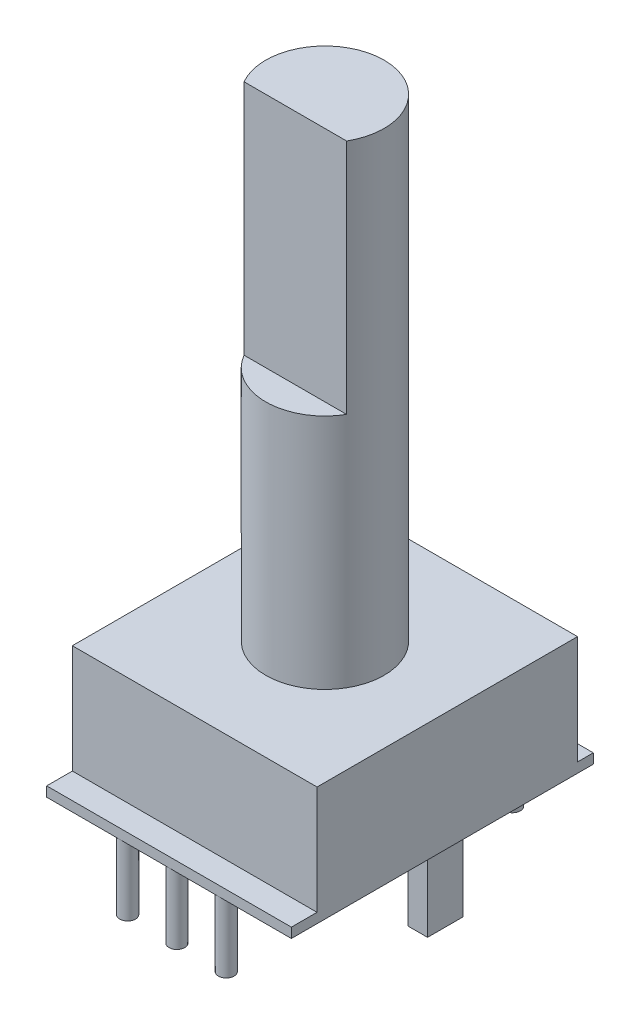
ISO-10303-21;
HEADER;
FILE_DESCRIPTION(('STEP AP214'),'2;1');
FILE_NAME('part.step','',(''),(''),'','','');
FILE_SCHEMA(('AUTOMOTIVE_DESIGN { 1 0 10303 214 1 1 1 1 }'));
ENDSEC;
DATA;
#1=APPLICATION_CONTEXT('core data for automotive mechanical design processes');
#2=APPLICATION_PROTOCOL_DEFINITION('international standard','automotive_design',2000,#1);
#3=PRODUCT_CONTEXT('',#1,'mechanical');
#4=PRODUCT('Part','Part','',(#3));
#5=PRODUCT_RELATED_PRODUCT_CATEGORY('part','',(#4));
#6=PRODUCT_DEFINITION_FORMATION('','',#4);
#7=PRODUCT_DEFINITION_CONTEXT('part definition',#1,'design');
#8=PRODUCT_DEFINITION('design','',#6,#7);
#9=PRODUCT_DEFINITION_SHAPE('','',#8);
#10=(LENGTH_UNIT() NAMED_UNIT(*) SI_UNIT(.MILLI.,.METRE.));
#11=(NAMED_UNIT(*) PLANE_ANGLE_UNIT() SI_UNIT($,.RADIAN.));
#12=(NAMED_UNIT(*) SI_UNIT($,.STERADIAN.) SOLID_ANGLE_UNIT());
#13=UNCERTAINTY_MEASURE_WITH_UNIT(LENGTH_MEASURE(1.E-05),#10,'distance_accuracy_value','');
#14=(GEOMETRIC_REPRESENTATION_CONTEXT(3) GLOBAL_UNCERTAINTY_ASSIGNED_CONTEXT((#13)) GLOBAL_UNIT_ASSIGNED_CONTEXT((#10,
#11,#12)) REPRESENTATION_CONTEXT('',''));
#15=CARTESIAN_POINT('',(0.,0.,0.));
#16=DIRECTION('',(0.,0.,1.));
#17=DIRECTION('',(1.,0.,0.));
#18=AXIS2_PLACEMENT_3D('',#15,#16,#17);
#19=CARTESIAN_POINT('',(0.,0.5,0.));
#20=DIRECTION('',(0.,1.,0.));
#21=DIRECTION('',(0.,0.,1.));
#22=AXIS2_PLACEMENT_3D('',#19,#20,#21);
#23=PLANE('',#22);
#24=DIRECTION('',(0.,0.,1.));
#25=VECTOR('',#24,1.);
#26=CARTESIAN_POINT('',(-6.2,0.5,-7.4));
#27=LINE('',#26,#25);
#28=CARTESIAN_POINT('',(-6.2,0.5,-7.4));
#29=VERTEX_POINT('',#28);
#30=CARTESIAN_POINT('',(-6.2,0.5,-6.6));
#31=VERTEX_POINT('',#30);
#32=EDGE_CURVE('E300',#29,#31,#27,.T.);
#33=ORIENTED_EDGE('',*,*,#32,.T.);
#34=DIRECTION('',(1.,0.,0.));
#35=VECTOR('',#34,1.);
#36=CARTESIAN_POINT('',(0.,0.5,-6.6));
#37=LINE('',#36,#35);
#38=CARTESIAN_POINT('',(6.2,0.5,-6.6));
#39=VERTEX_POINT('',#38);
#40=EDGE_CURVE('E37',#31,#39,#37,.T.);
#41=ORIENTED_EDGE('',*,*,#40,.T.);
#42=DIRECTION('',(0.,0.,-1.));
#43=VECTOR('',#42,1.);
#44=CARTESIAN_POINT('',(6.2,0.5,-7.4));
#45=LINE('',#44,#43);
#46=CARTESIAN_POINT('',(6.2,0.5,-7.4));
#47=VERTEX_POINT('',#46);
#48=EDGE_CURVE('E306',#39,#47,#45,.T.);
#49=ORIENTED_EDGE('',*,*,#48,.T.);
#50=DIRECTION('',(-1.,0.,0.));
#51=VECTOR('',#50,1.);
#52=CARTESIAN_POINT('',(-6.2,0.5,-7.4));
#53=LINE('',#52,#51);
#54=EDGE_CURVE('E310',#47,#29,#53,.T.);
#55=ORIENTED_EDGE('',*,*,#54,.T.);
#56=EDGE_LOOP('',(#33,#41,#49,#55));
#57=FACE_BOUND('',#56,.T.);
#58=ADVANCED_FACE('F33',(#57),#23,.T.);
#59=CARTESIAN_POINT('',(6.2,0.5,7.9));
#60=VERTEX_POINT('',#59);
#61=CARTESIAN_POINT('',(6.2,0.5,6.6));
#62=VERTEX_POINT('',#61);
#63=EDGE_CURVE('E307',#60,#62,#45,.T.);
#64=ORIENTED_EDGE('',*,*,#63,.T.);
#65=DIRECTION('',(-1.,0.,0.));
#66=VECTOR('',#65,1.);
#67=CARTESIAN_POINT('',(0.,0.5,6.6));
#68=LINE('',#67,#66);
#69=CARTESIAN_POINT('',(-6.2,0.5,6.6));
#70=VERTEX_POINT('',#69);
#71=EDGE_CURVE('E341',#62,#70,#68,.T.);
#72=ORIENTED_EDGE('',*,*,#71,.T.);
#73=CARTESIAN_POINT('',(-6.2,0.5,7.9));
#74=VERTEX_POINT('',#73);
#75=EDGE_CURVE('E304',#70,#74,#27,.T.);
#76=ORIENTED_EDGE('',*,*,#75,.T.);
#77=DIRECTION('',(1.,0.,0.));
#78=VECTOR('',#77,1.);
#79=CARTESIAN_POINT('',(-6.2,0.5,7.9));
#80=LINE('',#79,#78);
#81=EDGE_CURVE('E303',#74,#60,#80,.T.);
#82=ORIENTED_EDGE('',*,*,#81,.T.);
#83=EDGE_LOOP('',(#64,#72,#76,#82));
#84=FACE_BOUND('',#83,.T.);
#85=ADVANCED_FACE('F377',(#84),#23,.T.);
#86=CARTESIAN_POINT('',(-2.5,-3.5,7.5));
#87=DIRECTION('',(0.,1.,0.));
#88=DIRECTION('',(0.,0.,1.));
#89=AXIS2_PLACEMENT_3D('',#86,#87,#88);
#90=CYLINDRICAL_SURFACE('',#89,0.4);
#91=CARTESIAN_POINT('',(-2.5,-3.5,7.5));
#92=DIRECTION('',(0.,1.,0.));
#93=DIRECTION('',(0.,0.,1.));
#94=AXIS2_PLACEMENT_3D('',#91,#92,#93);
#95=CIRCLE('',#94,0.4);
#96=CARTESIAN_POINT('',(-2.5,-3.5,7.9));
#97=VERTEX_POINT('',#96);
#98=EDGE_CURVE('E338',#97,#97,#95,.T.);
#99=ORIENTED_EDGE('',*,*,#98,.T.);
#100=EDGE_LOOP('',(#99));
#101=FACE_BOUND('',#100,.T.);
#102=CARTESIAN_POINT('',(-2.5,0.,7.5));
#103=DIRECTION('',(0.,1.,0.));
#104=DIRECTION('',(0.,0.,1.));
#105=AXIS2_PLACEMENT_3D('',#102,#103,#104);
#106=CIRCLE('',#105,0.4);
#107=CARTESIAN_POINT('',(-2.5,0.,7.9));
#108=VERTEX_POINT('',#107);
#109=EDGE_CURVE('E337',#108,#108,#106,.T.);
#110=ORIENTED_EDGE('',*,*,#109,.F.);
#111=EDGE_LOOP('',(#110));
#112=FACE_BOUND('',#111,.T.);
#113=ADVANCED_FACE('F35',(#101,#112),#90,.T.);
#114=CARTESIAN_POINT('',(-2.5,-3.5,7.5));
#115=DIRECTION('',(0.,1.,0.));
#116=DIRECTION('',(0.,0.,1.));
#117=AXIS2_PLACEMENT_3D('',#114,#115,#116);
#118=PLANE('',#117);
#119=ORIENTED_EDGE('',*,*,#98,.F.);
#120=EDGE_LOOP('',(#119));
#121=FACE_BOUND('',#120,.T.);
#122=ADVANCED_FACE('F418',(#121),#118,.F.);
#123=CARTESIAN_POINT('',(0.,0.,0.));
#124=DIRECTION('',(0.,1.,0.));
#125=DIRECTION('',(0.,0.,1.));
#126=AXIS2_PLACEMENT_3D('',#123,#124,#125);
#127=PLANE('',#126);
#128=DIRECTION('',(-1.,0.,0.));
#129=VECTOR('',#128,1.);
#130=CARTESIAN_POINT('',(-6.1,0.,-0.899999999999999));
#131=LINE('',#130,#129);
#132=CARTESIAN_POINT('',(-5.1,0.,-0.9));
#133=VERTEX_POINT('',#132);
#134=CARTESIAN_POINT('',(-6.1,0.,-0.899999999999999));
#135=VERTEX_POINT('',#134);
#136=EDGE_CURVE('E251',#133,#135,#131,.T.);
#137=ORIENTED_EDGE('',*,*,#136,.T.);
#138=DIRECTION('',(0.,0.,1.));
#139=VECTOR('',#138,1.);
#140=CARTESIAN_POINT('',(-6.1,0.,-0.899999999999999));
#141=LINE('',#140,#139);
#142=CARTESIAN_POINT('',(-6.1,0.,0.900000000000001));
#143=VERTEX_POINT('',#142);
#144=EDGE_CURVE('E246',#135,#143,#141,.T.);
#145=ORIENTED_EDGE('',*,*,#144,.T.);
#146=DIRECTION('',(1.,0.,0.));
#147=VECTOR('',#146,1.);
#148=CARTESIAN_POINT('',(-6.1,0.,0.900000000000001));
#149=LINE('',#148,#147);
#150=CARTESIAN_POINT('',(-5.1,0.,0.900000000000001));
#151=VERTEX_POINT('',#150);
#152=EDGE_CURVE('E263',#143,#151,#149,.T.);
#153=ORIENTED_EDGE('',*,*,#152,.T.);
#154=DIRECTION('',(0.,0.,-1.));
#155=VECTOR('',#154,1.);
#156=CARTESIAN_POINT('',(-5.1,0.,-0.9));
#157=LINE('',#156,#155);
#158=EDGE_CURVE('E57',#151,#133,#157,.T.);
#159=ORIENTED_EDGE('',*,*,#158,.T.);
#160=EDGE_LOOP('',(#137,#145,#153,#159));
#161=FACE_BOUND('',#160,.T.);
#162=DIRECTION('',(-1.,0.,0.));
#163=VECTOR('',#162,1.);
#164=CARTESIAN_POINT('',(5.1,0.,-0.9));
#165=LINE('',#164,#163);
#166=CARTESIAN_POINT('',(6.1,0.,-0.9));
#167=VERTEX_POINT('',#166);
#168=CARTESIAN_POINT('',(5.1,0.,-0.9));
#169=VERTEX_POINT('',#168);
#170=EDGE_CURVE('E200',#167,#169,#165,.T.);
#171=ORIENTED_EDGE('',*,*,#170,.T.);
#172=DIRECTION('',(0.,0.,1.));
#173=VECTOR('',#172,1.);
#174=CARTESIAN_POINT('',(5.1,0.,-0.9));
#175=LINE('',#174,#173);
#176=CARTESIAN_POINT('',(5.1,0.,0.900000000000001));
#177=VERTEX_POINT('',#176);
#178=EDGE_CURVE('E194',#169,#177,#175,.T.);
#179=ORIENTED_EDGE('',*,*,#178,.T.);
#180=DIRECTION('',(1.,0.,0.));
#181=VECTOR('',#180,1.);
#182=CARTESIAN_POINT('',(5.1,0.,0.900000000000001));
#183=LINE('',#182,#181);
#184=CARTESIAN_POINT('',(6.1,0.,0.900000000000001));
#185=VERTEX_POINT('',#184);
#186=EDGE_CURVE('E212',#177,#185,#183,.T.);
#187=ORIENTED_EDGE('',*,*,#186,.T.);
#188=DIRECTION('',(0.,0.,-1.));
#189=VECTOR('',#188,1.);
#190=CARTESIAN_POINT('',(6.1,0.,-0.9));
#191=LINE('',#190,#189);
#192=EDGE_CURVE('E215',#185,#167,#191,.T.);
#193=ORIENTED_EDGE('',*,*,#192,.T.);
#194=EDGE_LOOP('',(#171,#179,#187,#193));
#195=FACE_BOUND('',#194,.T.);
#196=DIRECTION('',(1.,0.,0.));
#197=VECTOR('',#196,1.);
#198=CARTESIAN_POINT('',(-6.2,0.,7.9));
#199=LINE('',#198,#197);
#200=CARTESIAN_POINT('',(-6.2,0.,7.9));
#201=VERTEX_POINT('',#200);
#202=EDGE_CURVE('E315',#201,#108,#199,.T.);
#203=ORIENTED_EDGE('',*,*,#202,.F.);
#204=DIRECTION('',(0.,0.,1.));
#205=VECTOR('',#204,1.);
#206=CARTESIAN_POINT('',(-6.2,0.,-7.4));
#207=LINE('',#206,#205);
#208=CARTESIAN_POINT('',(-6.2,0.,-7.4));
#209=VERTEX_POINT('',#208);
#210=EDGE_CURVE('E297',#209,#201,#207,.T.);
#211=ORIENTED_EDGE('',*,*,#210,.F.);
#212=DIRECTION('',(-1.,0.,0.));
#213=VECTOR('',#212,1.);
#214=CARTESIAN_POINT('',(-6.2,0.,-7.4));
#215=LINE('',#214,#213);
#216=CARTESIAN_POINT('',(-2.5,0.,-7.4));
#217=VERTEX_POINT('',#216);
#218=EDGE_CURVE('E321',#217,#209,#215,.T.);
#219=ORIENTED_EDGE('',*,*,#218,.F.);
#220=CARTESIAN_POINT('',(-2.5,0.,-7.));
#221=DIRECTION('',(0.,1.,0.));
#222=DIRECTION('',(0.,0.,1.));
#223=AXIS2_PLACEMENT_3D('',#220,#221,#222);
#224=CIRCLE('',#223,0.4);
#225=EDGE_CURVE('E272',#217,#217,#224,.T.);
#226=ORIENTED_EDGE('',*,*,#225,.T.);
#227=CARTESIAN_POINT('',(2.5,0.,-7.4));
#228=VERTEX_POINT('',#227);
#229=EDGE_CURVE('E325',#228,#217,#215,.T.);
#230=ORIENTED_EDGE('',*,*,#229,.F.);
#231=CARTESIAN_POINT('',(2.5,0.,-7.));
#232=DIRECTION('',(0.,1.,0.));
#233=DIRECTION('',(0.,0.,1.));
#234=AXIS2_PLACEMENT_3D('',#231,#232,#233);
#235=CIRCLE('',#234,0.4);
#236=EDGE_CURVE('E281',#228,#228,#235,.T.);
#237=ORIENTED_EDGE('',*,*,#236,.T.);
#238=CARTESIAN_POINT('',(6.2,0.,-7.4));
#239=VERTEX_POINT('',#238);
#240=EDGE_CURVE('E322',#239,#228,#215,.T.);
#241=ORIENTED_EDGE('',*,*,#240,.F.);
#242=DIRECTION('',(0.,0.,-1.));
#243=VECTOR('',#242,1.);
#244=CARTESIAN_POINT('',(6.2,0.,-7.4));
#245=LINE('',#244,#243);
#246=CARTESIAN_POINT('',(6.2,0.,7.9));
#247=VERTEX_POINT('',#246);
#248=EDGE_CURVE('E318',#247,#239,#245,.T.);
#249=ORIENTED_EDGE('',*,*,#248,.F.);
#250=CARTESIAN_POINT('',(2.5,0.,7.9));
#251=VERTEX_POINT('',#250);
#252=EDGE_CURVE('E314',#251,#247,#199,.T.);
#253=ORIENTED_EDGE('',*,*,#252,.F.);
#254=CARTESIAN_POINT('',(2.5,0.,7.5));
#255=DIRECTION('',(0.,1.,0.));
#256=DIRECTION('',(0.,0.,1.));
#257=AXIS2_PLACEMENT_3D('',#254,#255,#256);
#258=CIRCLE('',#257,0.4);
#259=EDGE_CURVE('E286',#251,#251,#258,.T.);
#260=ORIENTED_EDGE('',*,*,#259,.T.);
#261=CARTESIAN_POINT('',(0.,0.,7.9));
#262=VERTEX_POINT('',#261);
#263=EDGE_CURVE('E438',#262,#251,#199,.T.);
#264=ORIENTED_EDGE('',*,*,#263,.F.);
#265=CARTESIAN_POINT('',(0.,0.,7.5));
#266=DIRECTION('',(0.,1.,0.));
#267=DIRECTION('',(0.,0.,1.));
#268=AXIS2_PLACEMENT_3D('',#265,#266,#267);
#269=CIRCLE('',#268,0.4);
#270=EDGE_CURVE('E291',#262,#262,#269,.T.);
#271=ORIENTED_EDGE('',*,*,#270,.T.);
#272=EDGE_CURVE('E319',#108,#262,#199,.T.);
#273=ORIENTED_EDGE('',*,*,#272,.F.);
#274=ORIENTED_EDGE('',*,*,#109,.T.);
#275=EDGE_LOOP('',(#203,#211,#219,#226,#230,#237,#241,#249,#253,#260,#264,#271,#273,#274));
#276=FACE_BOUND('',#275,.T.);
#277=ADVANCED_FACE('F387',(#161,#195,#276),#127,.F.);
#278=CARTESIAN_POINT('',(-6.2,0.5,-7.4));
#279=DIRECTION('',(1.,0.,0.));
#280=DIRECTION('',(0.,0.,-1.));
#281=AXIS2_PLACEMENT_3D('',#278,#279,#280);
#282=PLANE('',#281);
#283=ORIENTED_EDGE('',*,*,#210,.T.);
#284=DIRECTION('',(0.,-1.,0.));
#285=VECTOR('',#284,1.);
#286=CARTESIAN_POINT('',(-6.2,0.5,7.9));
#287=LINE('',#286,#285);
#288=EDGE_CURVE('E334',#74,#201,#287,.T.);
#289=ORIENTED_EDGE('',*,*,#288,.F.);
#290=ORIENTED_EDGE('',*,*,#75,.F.);
#291=DIRECTION('',(0.,-1.,0.));
#292=VECTOR('',#291,1.);
#293=CARTESIAN_POINT('',(-6.2,6.,6.6));
#294=LINE('',#293,#292);
#295=CARTESIAN_POINT('',(-6.2,6.,6.6));
#296=VERTEX_POINT('',#295);
#297=EDGE_CURVE('E239',#296,#70,#294,.T.);
#298=ORIENTED_EDGE('',*,*,#297,.F.);
#299=DIRECTION('',(0.,0.,1.));
#300=VECTOR('',#299,1.);
#301=CARTESIAN_POINT('',(-6.2,6.,-6.6));
#302=LINE('',#301,#300);
#303=CARTESIAN_POINT('',(-6.2,6.,-6.6));
#304=VERTEX_POINT('',#303);
#305=EDGE_CURVE('E232',#304,#296,#302,.T.);
#306=ORIENTED_EDGE('',*,*,#305,.F.);
#307=DIRECTION('',(0.,-1.,0.));
#308=VECTOR('',#307,1.);
#309=CARTESIAN_POINT('',(-6.2,6.,-6.6));
#310=LINE('',#309,#308);
#311=EDGE_CURVE('E241',#304,#31,#310,.T.);
#312=ORIENTED_EDGE('',*,*,#311,.T.);
#313=ORIENTED_EDGE('',*,*,#32,.F.);
#314=DIRECTION('',(0.,-1.,0.));
#315=VECTOR('',#314,1.);
#316=CARTESIAN_POINT('',(-6.2,0.5,-7.4));
#317=LINE('',#316,#315);
#318=EDGE_CURVE('E312',#29,#209,#317,.T.);
#319=ORIENTED_EDGE('',*,*,#318,.T.);
#320=EDGE_LOOP('',(#283,#289,#290,#298,#306,#312,#313,#319));
#321=FACE_BOUND('',#320,.T.);
#322=ADVANCED_FACE('F367',(#321),#282,.F.);
#323=CARTESIAN_POINT('',(-6.2,0.5,7.9));
#324=DIRECTION('',(0.,0.,-1.));
#325=DIRECTION('',(-1.,0.,0.));
#326=AXIS2_PLACEMENT_3D('',#323,#324,#325);
#327=PLANE('',#326);
#328=ORIENTED_EDGE('',*,*,#202,.T.);
#329=ORIENTED_EDGE('',*,*,#272,.T.);
#330=ORIENTED_EDGE('',*,*,#263,.T.);
#331=ORIENTED_EDGE('',*,*,#252,.T.);
#332=DIRECTION('',(0.,-1.,0.));
#333=VECTOR('',#332,1.);
#334=CARTESIAN_POINT('',(6.2,0.5,7.9));
#335=LINE('',#334,#333);
#336=EDGE_CURVE('E331',#60,#247,#335,.T.);
#337=ORIENTED_EDGE('',*,*,#336,.F.);
#338=ORIENTED_EDGE('',*,*,#81,.F.);
#339=ORIENTED_EDGE('',*,*,#288,.T.);
#340=EDGE_LOOP('',(#328,#329,#330,#331,#337,#338,#339));
#341=FACE_BOUND('',#340,.T.);
#342=ADVANCED_FACE('F382',(#341),#327,.F.);
#343=CARTESIAN_POINT('',(6.2,0.5,-7.4));
#344=DIRECTION('',(-1.,0.,0.));
#345=DIRECTION('',(0.,0.,1.));
#346=AXIS2_PLACEMENT_3D('',#343,#344,#345);
#347=PLANE('',#346);
#348=ORIENTED_EDGE('',*,*,#248,.T.);
#349=DIRECTION('',(0.,-1.,0.));
#350=VECTOR('',#349,1.);
#351=CARTESIAN_POINT('',(6.2,0.5,-7.4));
#352=LINE('',#351,#350);
#353=EDGE_CURVE('E328',#47,#239,#352,.T.);
#354=ORIENTED_EDGE('',*,*,#353,.F.);
#355=ORIENTED_EDGE('',*,*,#48,.F.);
#356=DIRECTION('',(0.,-1.,0.));
#357=VECTOR('',#356,1.);
#358=CARTESIAN_POINT('',(6.2,6.,-6.6));
#359=LINE('',#358,#357);
#360=CARTESIAN_POINT('',(6.2,6.,-6.6));
#361=VERTEX_POINT('',#360);
#362=EDGE_CURVE('E244',#361,#39,#359,.T.);
#363=ORIENTED_EDGE('',*,*,#362,.F.);
#364=DIRECTION('',(0.,0.,-1.));
#365=VECTOR('',#364,1.);
#366=CARTESIAN_POINT('',(6.2,6.,-6.6));
#367=LINE('',#366,#365);
#368=CARTESIAN_POINT('',(6.2,6.,6.6));
#369=VERTEX_POINT('',#368);
#370=EDGE_CURVE('E222',#369,#361,#367,.T.);
#371=ORIENTED_EDGE('',*,*,#370,.F.);
#372=DIRECTION('',(0.,-1.,0.));
#373=VECTOR('',#372,1.);
#374=CARTESIAN_POINT('',(6.2,6.,6.6));
#375=LINE('',#374,#373);
#376=EDGE_CURVE('E236',#369,#62,#375,.T.);
#377=ORIENTED_EDGE('',*,*,#376,.T.);
#378=ORIENTED_EDGE('',*,*,#63,.F.);
#379=ORIENTED_EDGE('',*,*,#336,.T.);
#380=EDGE_LOOP('',(#348,#354,#355,#363,#371,#377,#378,#379));
#381=FACE_BOUND('',#380,.T.);
#382=ADVANCED_FACE('F355',(#381),#347,.F.);
#383=CARTESIAN_POINT('',(-6.2,0.5,-7.4));
#384=DIRECTION('',(0.,0.,1.));
#385=DIRECTION('',(1.,0.,0.));
#386=AXIS2_PLACEMENT_3D('',#383,#384,#385);
#387=PLANE('',#386);
#388=ORIENTED_EDGE('',*,*,#240,.T.);
#389=ORIENTED_EDGE('',*,*,#229,.T.);
#390=ORIENTED_EDGE('',*,*,#218,.T.);
#391=ORIENTED_EDGE('',*,*,#318,.F.);
#392=ORIENTED_EDGE('',*,*,#54,.F.);
#393=ORIENTED_EDGE('',*,*,#353,.T.);
#394=EDGE_LOOP('',(#388,#389,#390,#391,#392,#393));
#395=FACE_BOUND('',#394,.T.);
#396=ADVANCED_FACE('F362',(#395),#387,.F.);
#397=CARTESIAN_POINT('',(0.,-3.5,7.5));
#398=DIRECTION('',(0.,1.,0.));
#399=DIRECTION('',(0.,0.,1.));
#400=AXIS2_PLACEMENT_3D('',#397,#398,#399);
#401=CYLINDRICAL_SURFACE('',#400,0.4);
#402=CARTESIAN_POINT('',(0.,-3.5,7.5));
#403=DIRECTION('',(0.,1.,0.));
#404=DIRECTION('',(0.,0.,1.));
#405=AXIS2_PLACEMENT_3D('',#402,#403,#404);
#406=CIRCLE('',#405,0.4);
#407=CARTESIAN_POINT('',(0.,-3.5,7.9));
#408=VERTEX_POINT('',#407);
#409=EDGE_CURVE('E294',#408,#408,#406,.T.);
#410=ORIENTED_EDGE('',*,*,#409,.T.);
#411=EDGE_LOOP('',(#410));
#412=FACE_BOUND('',#411,.T.);
#413=ORIENTED_EDGE('',*,*,#270,.F.);
#414=EDGE_LOOP('',(#413));
#415=FACE_BOUND('',#414,.T.);
#416=ADVANCED_FACE('F414',(#412,#415),#401,.T.);
#417=CARTESIAN_POINT('',(0.,-3.5,7.5));
#418=DIRECTION('',(0.,1.,0.));
#419=DIRECTION('',(0.,0.,1.));
#420=AXIS2_PLACEMENT_3D('',#417,#418,#419);
#421=PLANE('',#420);
#422=ORIENTED_EDGE('',*,*,#409,.F.);
#423=EDGE_LOOP('',(#422));
#424=FACE_BOUND('',#423,.T.);
#425=ADVANCED_FACE('F649',(#424),#421,.F.);
#426=CARTESIAN_POINT('',(2.5,-3.5,7.5));
#427=DIRECTION('',(0.,1.,0.));
#428=DIRECTION('',(0.,0.,1.));
#429=AXIS2_PLACEMENT_3D('',#426,#427,#428);
#430=CYLINDRICAL_SURFACE('',#429,0.4);
#431=CARTESIAN_POINT('',(2.5,-3.5,7.5));
#432=DIRECTION('',(0.,1.,0.));
#433=DIRECTION('',(0.,0.,1.));
#434=AXIS2_PLACEMENT_3D('',#431,#432,#433);
#435=CIRCLE('',#434,0.4);
#436=CARTESIAN_POINT('',(2.5,-3.5,7.9));
#437=VERTEX_POINT('',#436);
#438=EDGE_CURVE('E288',#437,#437,#435,.T.);
#439=ORIENTED_EDGE('',*,*,#438,.T.);
#440=EDGE_LOOP('',(#439));
#441=FACE_BOUND('',#440,.T.);
#442=ORIENTED_EDGE('',*,*,#259,.F.);
#443=EDGE_LOOP('',(#442));
#444=FACE_BOUND('',#443,.T.);
#445=ADVANCED_FACE('F657',(#441,#444),#430,.T.);
#446=CARTESIAN_POINT('',(2.5,-3.5,7.5));
#447=DIRECTION('',(0.,1.,0.));
#448=DIRECTION('',(0.,0.,1.));
#449=AXIS2_PLACEMENT_3D('',#446,#447,#448);
#450=PLANE('',#449);
#451=ORIENTED_EDGE('',*,*,#438,.F.);
#452=EDGE_LOOP('',(#451));
#453=FACE_BOUND('',#452,.T.);
#454=ADVANCED_FACE('F665',(#453),#450,.F.);
#455=CARTESIAN_POINT('',(2.5,-3.5,-7.));
#456=DIRECTION('',(0.,1.,0.));
#457=DIRECTION('',(0.,0.,1.));
#458=AXIS2_PLACEMENT_3D('',#455,#456,#457);
#459=CYLINDRICAL_SURFACE('',#458,0.4);
#460=CARTESIAN_POINT('',(2.5,-3.5,-7.));
#461=DIRECTION('',(0.,1.,0.));
#462=DIRECTION('',(0.,0.,1.));
#463=AXIS2_PLACEMENT_3D('',#460,#461,#462);
#464=CIRCLE('',#463,0.4);
#465=CARTESIAN_POINT('',(2.5,-3.5,-6.6));
#466=VERTEX_POINT('',#465);
#467=EDGE_CURVE('E283',#466,#466,#464,.T.);
#468=ORIENTED_EDGE('',*,*,#467,.T.);
#469=EDGE_LOOP('',(#468));
#470=FACE_BOUND('',#469,.T.);
#471=ORIENTED_EDGE('',*,*,#236,.F.);
#472=EDGE_LOOP('',(#471));
#473=FACE_BOUND('',#472,.T.);
#474=ADVANCED_FACE('F404',(#470,#473),#459,.T.);
#475=CARTESIAN_POINT('',(2.5,-3.5,-7.));
#476=DIRECTION('',(0.,1.,0.));
#477=DIRECTION('',(0.,0.,1.));
#478=AXIS2_PLACEMENT_3D('',#475,#476,#477);
#479=PLANE('',#478);
#480=ORIENTED_EDGE('',*,*,#467,.F.);
#481=EDGE_LOOP('',(#480));
#482=FACE_BOUND('',#481,.T.);
#483=ADVANCED_FACE('F395',(#482),#479,.F.);
#484=CARTESIAN_POINT('',(-2.5,-3.5,-7.));
#485=DIRECTION('',(0.,1.,0.));
#486=DIRECTION('',(0.,0.,1.));
#487=AXIS2_PLACEMENT_3D('',#484,#485,#486);
#488=CYLINDRICAL_SURFACE('',#487,0.4);
#489=CARTESIAN_POINT('',(-2.5,-3.5,-7.));
#490=DIRECTION('',(0.,1.,0.));
#491=DIRECTION('',(0.,0.,1.));
#492=AXIS2_PLACEMENT_3D('',#489,#490,#491);
#493=CIRCLE('',#492,0.4);
#494=CARTESIAN_POINT('',(-2.5,-3.5,-6.6));
#495=VERTEX_POINT('',#494);
#496=EDGE_CURVE('E278',#495,#495,#493,.T.);
#497=ORIENTED_EDGE('',*,*,#496,.T.);
#498=EDGE_LOOP('',(#497));
#499=FACE_BOUND('',#498,.T.);
#500=ORIENTED_EDGE('',*,*,#225,.F.);
#501=EDGE_LOOP('',(#500));
#502=FACE_BOUND('',#501,.T.);
#503=ADVANCED_FACE('F392',(#499,#502),#488,.T.);
#504=CARTESIAN_POINT('',(-2.5,-3.5,-7.));
#505=DIRECTION('',(0.,1.,0.));
#506=DIRECTION('',(0.,0.,1.));
#507=AXIS2_PLACEMENT_3D('',#504,#505,#506);
#508=PLANE('',#507);
#509=ORIENTED_EDGE('',*,*,#496,.F.);
#510=EDGE_LOOP('',(#509));
#511=FACE_BOUND('',#510,.T.);
#512=ADVANCED_FACE('F394',(#511),#508,.F.);
#513=CARTESIAN_POINT('',(0.,6.,0.));
#514=DIRECTION('',(0.,1.,0.));
#515=DIRECTION('',(0.,0.,1.));
#516=AXIS2_PLACEMENT_3D('',#513,#514,#515);
#517=PLANE('',#516);
#518=CARTESIAN_POINT('',(0.,6.,0.));
#519=DIRECTION('',(0.,1.,0.));
#520=DIRECTION('',(0.,0.,1.));
#521=AXIS2_PLACEMENT_3D('',#518,#519,#520);
#522=CIRCLE('',#521,3.);
#523=CARTESIAN_POINT('',(0.,6.,3.));
#524=VERTEX_POINT('',#523);
#525=EDGE_CURVE('E11',#524,#524,#522,.T.);
#526=ORIENTED_EDGE('',*,*,#525,.F.);
#527=EDGE_LOOP('',(#526));
#528=FACE_BOUND('',#527,.T.);
#529=ORIENTED_EDGE('',*,*,#370,.T.);
#530=DIRECTION('',(-1.,0.,0.));
#531=VECTOR('',#530,1.);
#532=CARTESIAN_POINT('',(-6.2,6.,-6.6));
#533=LINE('',#532,#531);
#534=EDGE_CURVE('E230',#361,#304,#533,.T.);
#535=ORIENTED_EDGE('',*,*,#534,.T.);
#536=ORIENTED_EDGE('',*,*,#305,.T.);
#537=DIRECTION('',(1.,0.,0.));
#538=VECTOR('',#537,1.);
#539=CARTESIAN_POINT('',(-6.2,6.,6.6));
#540=LINE('',#539,#538);
#541=EDGE_CURVE('E234',#296,#369,#540,.T.);
#542=ORIENTED_EDGE('',*,*,#541,.T.);
#543=EDGE_LOOP('',(#529,#535,#536,#542));
#544=FACE_BOUND('',#543,.T.);
#545=ADVANCED_FACE('F372',(#528,#544),#517,.T.);
#546=CARTESIAN_POINT('',(-6.2,6.,6.6));
#547=DIRECTION('',(0.,0.,-1.));
#548=DIRECTION('',(-1.,0.,0.));
#549=AXIS2_PLACEMENT_3D('',#546,#547,#548);
#550=PLANE('',#549);
#551=ORIENTED_EDGE('',*,*,#71,.F.);
#552=ORIENTED_EDGE('',*,*,#376,.F.);
#553=ORIENTED_EDGE('',*,*,#541,.F.);
#554=ORIENTED_EDGE('',*,*,#297,.T.);
#555=EDGE_LOOP('',(#551,#552,#553,#554));
#556=FACE_BOUND('',#555,.T.);
#557=ADVANCED_FACE('F439',(#556),#550,.F.);
#558=CARTESIAN_POINT('',(-6.2,6.,-6.6));
#559=DIRECTION('',(0.,0.,1.));
#560=DIRECTION('',(1.,0.,0.));
#561=AXIS2_PLACEMENT_3D('',#558,#559,#560);
#562=PLANE('',#561);
#563=ORIENTED_EDGE('',*,*,#40,.F.);
#564=ORIENTED_EDGE('',*,*,#311,.F.);
#565=ORIENTED_EDGE('',*,*,#534,.F.);
#566=ORIENTED_EDGE('',*,*,#362,.T.);
#567=EDGE_LOOP('',(#563,#564,#565,#566));
#568=FACE_BOUND('',#567,.T.);
#569=ADVANCED_FACE('F370',(#568),#562,.F.);
#570=CARTESIAN_POINT('',(0.,-3.5,0.));
#571=DIRECTION('',(0.,1.,0.));
#572=DIRECTION('',(0.,0.,1.));
#573=AXIS2_PLACEMENT_3D('',#570,#571,#572);
#574=PLANE('',#573);
#575=DIRECTION('',(0.,0.,1.));
#576=VECTOR('',#575,1.);
#577=CARTESIAN_POINT('',(5.1,-3.5,-0.9));
#578=LINE('',#577,#576);
#579=CARTESIAN_POINT('',(5.1,-3.5,-0.9));
#580=VERTEX_POINT('',#579);
#581=CARTESIAN_POINT('',(5.1,-3.5,0.900000000000001));
#582=VERTEX_POINT('',#581);
#583=EDGE_CURVE('E196',#580,#582,#578,.T.);
#584=ORIENTED_EDGE('',*,*,#583,.F.);
#585=DIRECTION('',(-1.,0.,0.));
#586=VECTOR('',#585,1.);
#587=CARTESIAN_POINT('',(5.1,-3.5,-0.9));
#588=LINE('',#587,#586);
#589=CARTESIAN_POINT('',(6.1,-3.5,-0.9));
#590=VERTEX_POINT('',#589);
#591=EDGE_CURVE('E206',#590,#580,#588,.T.);
#592=ORIENTED_EDGE('',*,*,#591,.F.);
#593=DIRECTION('',(0.,0.,-1.));
#594=VECTOR('',#593,1.);
#595=CARTESIAN_POINT('',(6.1,-3.5,-0.9));
#596=LINE('',#595,#594);
#597=CARTESIAN_POINT('',(6.1,-3.5,0.900000000000001));
#598=VERTEX_POINT('',#597);
#599=EDGE_CURVE('E203',#598,#590,#596,.T.);
#600=ORIENTED_EDGE('',*,*,#599,.F.);
#601=DIRECTION('',(1.,0.,0.));
#602=VECTOR('',#601,1.);
#603=CARTESIAN_POINT('',(5.1,-3.5,0.900000000000001));
#604=LINE('',#603,#602);
#605=EDGE_CURVE('E199',#582,#598,#604,.T.);
#606=ORIENTED_EDGE('',*,*,#605,.F.);
#607=EDGE_LOOP('',(#584,#592,#600,#606));
#608=FACE_BOUND('',#607,.T.);
#609=ADVANCED_FACE('F446',(#608),#574,.F.);
#610=CARTESIAN_POINT('',(5.1,-3.5,0.900000000000001));
#611=DIRECTION('',(0.,0.,1.));
#612=DIRECTION('',(1.,0.,0.));
#613=AXIS2_PLACEMENT_3D('',#610,#611,#612);
#614=PLANE('',#613);
#615=ORIENTED_EDGE('',*,*,#186,.F.);
#616=DIRECTION('',(0.,1.,0.));
#617=VECTOR('',#616,1.);
#618=CARTESIAN_POINT('',(5.1,-3.5,0.900000000000001));
#619=LINE('',#618,#617);
#620=EDGE_CURVE('E209',#582,#177,#619,.T.);
#621=ORIENTED_EDGE('',*,*,#620,.F.);
#622=ORIENTED_EDGE('',*,*,#605,.T.);
#623=DIRECTION('',(0.,1.,0.));
#624=VECTOR('',#623,1.);
#625=CARTESIAN_POINT('',(6.1,-3.5,0.900000000000001));
#626=LINE('',#625,#624);
#627=EDGE_CURVE('E225',#598,#185,#626,.T.);
#628=ORIENTED_EDGE('',*,*,#627,.T.);
#629=EDGE_LOOP('',(#615,#621,#622,#628));
#630=FACE_BOUND('',#629,.T.);
#631=ADVANCED_FACE('F492',(#630),#614,.T.);
#632=CARTESIAN_POINT('',(6.1,-3.5,-0.9));
#633=DIRECTION('',(1.,0.,0.));
#634=DIRECTION('',(0.,0.,-1.));
#635=AXIS2_PLACEMENT_3D('',#632,#633,#634);
#636=PLANE('',#635);
#637=ORIENTED_EDGE('',*,*,#192,.F.);
#638=ORIENTED_EDGE('',*,*,#627,.F.);
#639=ORIENTED_EDGE('',*,*,#599,.T.);
#640=DIRECTION('',(0.,1.,0.));
#641=VECTOR('',#640,1.);
#642=CARTESIAN_POINT('',(6.1,-3.5,-0.9));
#643=LINE('',#642,#641);
#644=EDGE_CURVE('E223',#590,#167,#643,.T.);
#645=ORIENTED_EDGE('',*,*,#644,.T.);
#646=EDGE_LOOP('',(#637,#638,#639,#645));
#647=FACE_BOUND('',#646,.T.);
#648=ADVANCED_FACE('F495',(#647),#636,.T.);
#649=CARTESIAN_POINT('',(5.1,-3.5,-0.9));
#650=DIRECTION('',(0.,0.,-1.));
#651=DIRECTION('',(-1.,0.,0.));
#652=AXIS2_PLACEMENT_3D('',#649,#650,#651);
#653=PLANE('',#652);
#654=ORIENTED_EDGE('',*,*,#170,.F.);
#655=ORIENTED_EDGE('',*,*,#644,.F.);
#656=ORIENTED_EDGE('',*,*,#591,.T.);
#657=DIRECTION('',(0.,1.,0.));
#658=VECTOR('',#657,1.);
#659=CARTESIAN_POINT('',(5.1,-3.5,-0.9));
#660=LINE('',#659,#658);
#661=EDGE_CURVE('E220',#580,#169,#660,.T.);
#662=ORIENTED_EDGE('',*,*,#661,.T.);
#663=EDGE_LOOP('',(#654,#655,#656,#662));
#664=FACE_BOUND('',#663,.T.);
#665=ADVANCED_FACE('F474',(#664),#653,.T.);
#666=CARTESIAN_POINT('',(5.1,-3.5,-0.9));
#667=DIRECTION('',(-1.,0.,0.));
#668=DIRECTION('',(0.,0.,1.));
#669=AXIS2_PLACEMENT_3D('',#666,#667,#668);
#670=PLANE('',#669);
#671=ORIENTED_EDGE('',*,*,#178,.F.);
#672=ORIENTED_EDGE('',*,*,#661,.F.);
#673=ORIENTED_EDGE('',*,*,#583,.T.);
#674=ORIENTED_EDGE('',*,*,#620,.T.);
#675=EDGE_LOOP('',(#671,#672,#673,#674));
#676=FACE_BOUND('',#675,.T.);
#677=ADVANCED_FACE('F469',(#676),#670,.T.);
#678=CARTESIAN_POINT('',(-6.1,-3.5,-0.899999999999999));
#679=DIRECTION('',(-1.,0.,0.));
#680=DIRECTION('',(0.,0.,1.));
#681=AXIS2_PLACEMENT_3D('',#678,#679,#680);
#682=PLANE('',#681);
#683=ORIENTED_EDGE('',*,*,#144,.F.);
#684=DIRECTION('',(0.,1.,0.));
#685=VECTOR('',#684,1.);
#686=CARTESIAN_POINT('',(-6.1,-3.5,-0.899999999999999));
#687=LINE('',#686,#685);
#688=CARTESIAN_POINT('',(-6.1,-3.5,-0.899999999999999));
#689=VERTEX_POINT('',#688);
#690=EDGE_CURVE('E269',#689,#135,#687,.T.);
#691=ORIENTED_EDGE('',*,*,#690,.F.);
#692=DIRECTION('',(0.,0.,1.));
#693=VECTOR('',#692,1.);
#694=CARTESIAN_POINT('',(-6.1,-3.5,-0.899999999999999));
#695=LINE('',#694,#693);
#696=CARTESIAN_POINT('',(-6.1,-3.5,0.900000000000001));
#697=VERTEX_POINT('',#696);
#698=EDGE_CURVE('E247',#689,#697,#695,.T.);
#699=ORIENTED_EDGE('',*,*,#698,.T.);
#700=DIRECTION('',(0.,1.,0.));
#701=VECTOR('',#700,1.);
#702=CARTESIAN_POINT('',(-6.1,-3.5,0.900000000000001));
#703=LINE('',#702,#701);
#704=EDGE_CURVE('E260',#697,#143,#703,.T.);
#705=ORIENTED_EDGE('',*,*,#704,.T.);
#706=EDGE_LOOP('',(#683,#691,#699,#705));
#707=FACE_BOUND('',#706,.T.);
#708=ADVANCED_FACE('F461',(#707),#682,.T.);
#709=CARTESIAN_POINT('',(-6.1,-3.5,-0.899999999999999));
#710=DIRECTION('',(0.,0.,-1.));
#711=DIRECTION('',(-1.,0.,0.));
#712=AXIS2_PLACEMENT_3D('',#709,#710,#711);
#713=PLANE('',#712);
#714=ORIENTED_EDGE('',*,*,#136,.F.);
#715=DIRECTION('',(0.,1.,0.));
#716=VECTOR('',#715,1.);
#717=CARTESIAN_POINT('',(-5.1,-3.5,-0.9));
#718=LINE('',#717,#716);
#719=CARTESIAN_POINT('',(-5.1,-3.5,-0.9));
#720=VERTEX_POINT('',#719);
#721=EDGE_CURVE('E273',#720,#133,#718,.T.);
#722=ORIENTED_EDGE('',*,*,#721,.F.);
#723=DIRECTION('',(-1.,0.,0.));
#724=VECTOR('',#723,1.);
#725=CARTESIAN_POINT('',(-6.1,-3.5,-0.899999999999999));
#726=LINE('',#725,#724);
#727=EDGE_CURVE('E257',#720,#689,#726,.T.);
#728=ORIENTED_EDGE('',*,*,#727,.T.);
#729=ORIENTED_EDGE('',*,*,#690,.T.);
#730=EDGE_LOOP('',(#714,#722,#728,#729));
#731=FACE_BOUND('',#730,.T.);
#732=ADVANCED_FACE('F457',(#731),#713,.T.);
#733=CARTESIAN_POINT('',(-5.1,-3.5,-0.9));
#734=DIRECTION('',(1.,0.,0.));
#735=DIRECTION('',(0.,0.,-1.));
#736=AXIS2_PLACEMENT_3D('',#733,#734,#735);
#737=PLANE('',#736);
#738=ORIENTED_EDGE('',*,*,#158,.F.);
#739=DIRECTION('',(0.,1.,0.));
#740=VECTOR('',#739,1.);
#741=CARTESIAN_POINT('',(-5.1,-3.5,0.900000000000001));
#742=LINE('',#741,#740);
#743=CARTESIAN_POINT('',(-5.1,-3.5,0.900000000000001));
#744=VERTEX_POINT('',#743);
#745=EDGE_CURVE('E275',#744,#151,#742,.T.);
#746=ORIENTED_EDGE('',*,*,#745,.F.);
#747=DIRECTION('',(0.,0.,-1.));
#748=VECTOR('',#747,1.);
#749=CARTESIAN_POINT('',(-5.1,-3.5,-0.9));
#750=LINE('',#749,#748);
#751=EDGE_CURVE('E254',#744,#720,#750,.T.);
#752=ORIENTED_EDGE('',*,*,#751,.T.);
#753=ORIENTED_EDGE('',*,*,#721,.T.);
#754=EDGE_LOOP('',(#738,#746,#752,#753));
#755=FACE_BOUND('',#754,.T.);
#756=ADVANCED_FACE('F460',(#755),#737,.T.);
#757=CARTESIAN_POINT('',(-6.1,-3.5,0.900000000000001));
#758=DIRECTION('',(0.,0.,1.));
#759=DIRECTION('',(1.,0.,0.));
#760=AXIS2_PLACEMENT_3D('',#757,#758,#759);
#761=PLANE('',#760);
#762=ORIENTED_EDGE('',*,*,#152,.F.);
#763=ORIENTED_EDGE('',*,*,#704,.F.);
#764=DIRECTION('',(1.,0.,0.));
#765=VECTOR('',#764,1.);
#766=CARTESIAN_POINT('',(-6.1,-3.5,0.900000000000001));
#767=LINE('',#766,#765);
#768=EDGE_CURVE('E250',#697,#744,#767,.T.);
#769=ORIENTED_EDGE('',*,*,#768,.T.);
#770=ORIENTED_EDGE('',*,*,#745,.T.);
#771=EDGE_LOOP('',(#762,#763,#769,#770));
#772=FACE_BOUND('',#771,.T.);
#773=ADVANCED_FACE('F455',(#772),#761,.T.);
#774=CARTESIAN_POINT('',(0.,-3.5,0.));
#775=DIRECTION('',(0.,1.,0.));
#776=DIRECTION('',(0.,0.,1.));
#777=AXIS2_PLACEMENT_3D('',#774,#775,#776);
#778=PLANE('',#777);
#779=ORIENTED_EDGE('',*,*,#698,.F.);
#780=ORIENTED_EDGE('',*,*,#727,.F.);
#781=ORIENTED_EDGE('',*,*,#751,.F.);
#782=ORIENTED_EDGE('',*,*,#768,.F.);
#783=EDGE_LOOP('',(#779,#780,#781,#782));
#784=FACE_BOUND('',#783,.T.);
#785=ADVANCED_FACE('F452',(#784),#778,.F.);
#786=CARTESIAN_POINT('',(0.,30.,0.));
#787=DIRECTION('',(0.,-1.,0.));
#788=DIRECTION('',(0.,0.,-1.));
#789=AXIS2_PLACEMENT_3D('',#786,#787,#788);
#790=CYLINDRICAL_SURFACE('',#789,3.);
#791=CARTESIAN_POINT('',(0.,30.,0.));
#792=DIRECTION('',(0.,1.,0.));
#793=DIRECTION('',(0.,0.,1.));
#794=AXIS2_PLACEMENT_3D('',#791,#792,#793);
#795=CIRCLE('',#794,3.);
#796=CARTESIAN_POINT('',(2.59807621135332,30.,1.5));
#797=VERTEX_POINT('',#796);
#798=CARTESIAN_POINT('',(-2.59807621135332,30.,1.5));
#799=VERTEX_POINT('',#798);
#800=EDGE_CURVE('E189',#797,#799,#795,.T.);
#801=ORIENTED_EDGE('',*,*,#800,.F.);
#802=DIRECTION('',(0.,1.,0.));
#803=VECTOR('',#802,1.);
#804=CARTESIAN_POINT('',(2.59807621135332,18.,1.5));
#805=LINE('',#804,#803);
#806=CARTESIAN_POINT('',(2.59807621135332,18.,1.5));
#807=VERTEX_POINT('',#806);
#808=EDGE_CURVE('E49',#807,#797,#805,.T.);
#809=ORIENTED_EDGE('',*,*,#808,.F.);
#810=CARTESIAN_POINT('',(0.,18.,0.));
#811=DIRECTION('',(0.,1.,0.));
#812=DIRECTION('',(0.,0.,1.));
#813=AXIS2_PLACEMENT_3D('',#810,#811,#812);
#814=CIRCLE('',#813,3.);
#815=CARTESIAN_POINT('',(-2.59807621135332,18.,1.5));
#816=VERTEX_POINT('',#815);
#817=EDGE_CURVE('E175',#816,#807,#814,.T.);
#818=ORIENTED_EDGE('',*,*,#817,.F.);
#819=DIRECTION('',(0.,1.,0.));
#820=VECTOR('',#819,1.);
#821=CARTESIAN_POINT('',(-2.59807621135332,18.,1.5));
#822=LINE('',#821,#820);
#823=EDGE_CURVE('E183',#816,#799,#822,.T.);
#824=ORIENTED_EDGE('',*,*,#823,.T.);
#825=EDGE_LOOP('',(#801,#809,#818,#824));
#826=FACE_BOUND('',#825,.T.);
#827=ORIENTED_EDGE('',*,*,#525,.T.);
#828=EDGE_LOOP('',(#827));
#829=FACE_BOUND('',#828,.T.);
#830=ADVANCED_FACE('F186',(#826,#829),#790,.T.);
#831=CARTESIAN_POINT('',(0.,30.,0.));
#832=DIRECTION('',(0.,1.,0.));
#833=DIRECTION('',(0.,0.,1.));
#834=AXIS2_PLACEMENT_3D('',#831,#832,#833);
#835=PLANE('',#834);
#836=DIRECTION('',(-1.,0.,0.));
#837=VECTOR('',#836,1.);
#838=CARTESIAN_POINT('',(-2.59807621135332,30.,1.5));
#839=LINE('',#838,#837);
#840=EDGE_CURVE('E180',#797,#799,#839,.T.);
#841=ORIENTED_EDGE('',*,*,#840,.F.);
#842=ORIENTED_EDGE('',*,*,#800,.T.);
#843=EDGE_LOOP('',(#841,#842));
#844=FACE_BOUND('',#843,.T.);
#845=ADVANCED_FACE('F567',(#844),#835,.T.);
#846=CARTESIAN_POINT('',(-2.59807621135332,18.,1.5));
#847=DIRECTION('',(0.,0.,-1.));
#848=DIRECTION('',(-1.,0.,0.));
#849=AXIS2_PLACEMENT_3D('',#846,#847,#848);
#850=PLANE('',#849);
#851=ORIENTED_EDGE('',*,*,#840,.T.);
#852=ORIENTED_EDGE('',*,*,#823,.F.);
#853=DIRECTION('',(-1.,0.,0.));
#854=VECTOR('',#853,1.);
#855=CARTESIAN_POINT('',(-2.59807621135332,18.,1.5));
#856=LINE('',#855,#854);
#857=EDGE_CURVE('E177',#807,#816,#856,.T.);
#858=ORIENTED_EDGE('',*,*,#857,.F.);
#859=ORIENTED_EDGE('',*,*,#808,.T.);
#860=EDGE_LOOP('',(#851,#852,#858,#859));
#861=FACE_BOUND('',#860,.T.);
#862=ADVANCED_FACE('F182',(#861),#850,.F.);
#863=CARTESIAN_POINT('',(0.,18.,0.));
#864=DIRECTION('',(0.,1.,0.));
#865=DIRECTION('',(0.,0.,1.));
#866=AXIS2_PLACEMENT_3D('',#863,#864,#865);
#867=PLANE('',#866);
#868=ORIENTED_EDGE('',*,*,#817,.T.);
#869=ORIENTED_EDGE('',*,*,#857,.T.);
#870=EDGE_LOOP('',(#868,#869));
#871=FACE_BOUND('',#870,.T.);
#872=ADVANCED_FACE('F176',(#871),#867,.T.);
#873=CLOSED_SHELL('',(#58,#85,#113,#122,#277,#322,#342,#382,#396,#416,#425,#445,#454,#474,#483,
#503,#512,#545,#557,#569,#609,#631,#648,#665,#677,#708,#732,#756,#773,#785,#830,#845,#862,#872));
#874=MANIFOLD_SOLID_BREP('B2',#873);
#875=ADVANCED_BREP_SHAPE_REPRESENTATION('',(#18,#874),#14);
#876=SHAPE_DEFINITION_REPRESENTATION(#9,#875);
ENDSEC;
END-ISO-10303-21;
